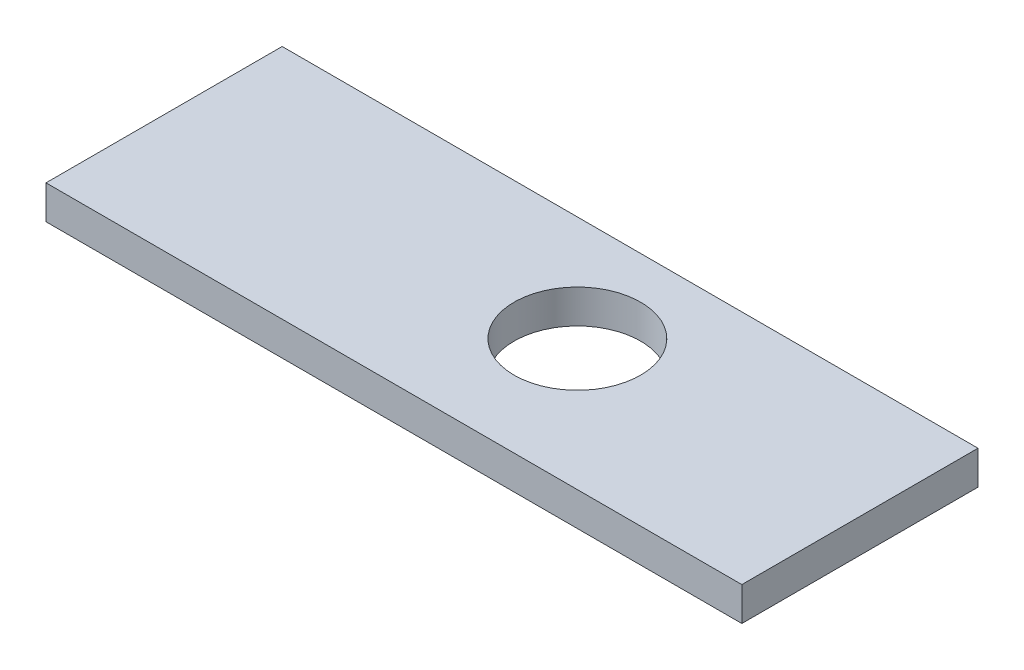
ISO-10303-21;
HEADER;
FILE_DESCRIPTION(('STEP AP214'),'2;1');
FILE_NAME('part.step','',(''),(''),'','','');
FILE_SCHEMA(('AUTOMOTIVE_DESIGN { 1 0 10303 214 1 1 1 1 }'));
ENDSEC;
DATA;
#1=APPLICATION_CONTEXT('core data for automotive mechanical design processes');
#2=APPLICATION_PROTOCOL_DEFINITION('international standard','automotive_design',2000,#1);
#3=PRODUCT_CONTEXT('',#1,'mechanical');
#4=PRODUCT('Part','Part','',(#3));
#5=PRODUCT_RELATED_PRODUCT_CATEGORY('part','',(#4));
#6=PRODUCT_DEFINITION_FORMATION('','',#4);
#7=PRODUCT_DEFINITION_CONTEXT('part definition',#1,'design');
#8=PRODUCT_DEFINITION('design','',#6,#7);
#9=PRODUCT_DEFINITION_SHAPE('','',#8);
#10=(LENGTH_UNIT() NAMED_UNIT(*) SI_UNIT(.MILLI.,.METRE.));
#11=(NAMED_UNIT(*) PLANE_ANGLE_UNIT() SI_UNIT($,.RADIAN.));
#12=(NAMED_UNIT(*) SI_UNIT($,.STERADIAN.) SOLID_ANGLE_UNIT());
#13=UNCERTAINTY_MEASURE_WITH_UNIT(LENGTH_MEASURE(1.E-05),#10,'distance_accuracy_value','');
#14=(GEOMETRIC_REPRESENTATION_CONTEXT(3) GLOBAL_UNCERTAINTY_ASSIGNED_CONTEXT((#13)) GLOBAL_UNIT_ASSIGNED_CONTEXT((#10,
#11,#12)) REPRESENTATION_CONTEXT('',''));
#15=CARTESIAN_POINT('',(0.,0.,0.));
#16=DIRECTION('',(0.,0.,1.));
#17=DIRECTION('',(1.,0.,0.));
#18=AXIS2_PLACEMENT_3D('',#15,#16,#17);
#19=CARTESIAN_POINT('',(0.,8.,0.));
#20=DIRECTION('',(0.,1.,0.));
#21=DIRECTION('',(0.,0.,1.));
#22=AXIS2_PLACEMENT_3D('',#19,#20,#21);
#23=PLANE('',#22);
#24=CARTESIAN_POINT('',(12.5,8.,-3.));
#25=DIRECTION('',(0.,1.,0.));
#26=DIRECTION('',(0.,0.,1.));
#27=AXIS2_PLACEMENT_3D('',#24,#25,#26);
#28=CIRCLE('',#27,15.);
#29=CARTESIAN_POINT('',(12.5,8.,12.));
#30=VERTEX_POINT('',#29);
#31=EDGE_CURVE('E20',#30,#30,#28,.F.);
#32=ORIENTED_EDGE('',*,*,#31,.T.);
#33=EDGE_LOOP('',(#32));
#34=FACE_BOUND('',#33,.T.);
#35=DIRECTION('',(-1.,0.,0.));
#36=VECTOR('',#35,1.);
#37=CARTESIAN_POINT('',(82.5,8.,-28.));
#38=LINE('',#37,#36);
#39=CARTESIAN_POINT('',(-82.5,8.,-28.));
#40=VERTEX_POINT('',#39);
#41=CARTESIAN_POINT('',(82.5,8.,-28.));
#42=VERTEX_POINT('',#41);
#43=EDGE_CURVE('E70',#40,#42,#38,.F.);
#44=ORIENTED_EDGE('',*,*,#43,.F.);
#45=DIRECTION('',(0.,0.,1.));
#46=VECTOR('',#45,1.);
#47=CARTESIAN_POINT('',(-82.5,8.,-28.));
#48=LINE('',#47,#46);
#49=CARTESIAN_POINT('',(-82.5,8.,28.));
#50=VERTEX_POINT('',#49);
#51=EDGE_CURVE('E67',#50,#40,#48,.F.);
#52=ORIENTED_EDGE('',*,*,#51,.F.);
#53=DIRECTION('',(1.,0.,0.));
#54=VECTOR('',#53,1.);
#55=CARTESIAN_POINT('',(-82.5,8.,28.));
#56=LINE('',#55,#54);
#57=CARTESIAN_POINT('',(82.5,8.,28.));
#58=VERTEX_POINT('',#57);
#59=EDGE_CURVE('E58',#58,#50,#56,.F.);
#60=ORIENTED_EDGE('',*,*,#59,.F.);
#61=DIRECTION('',(0.,0.,-1.));
#62=VECTOR('',#61,1.);
#63=CARTESIAN_POINT('',(82.5,8.,28.));
#64=LINE('',#63,#62);
#65=EDGE_CURVE('E53',#42,#58,#64,.F.);
#66=ORIENTED_EDGE('',*,*,#65,.F.);
#67=EDGE_LOOP('',(#44,#52,#60,#66));
#68=FACE_BOUND('',#67,.T.);
#69=ADVANCED_FACE('F17',(#34,#68),#23,.T.);
#70=CARTESIAN_POINT('',(-82.5,0.,-28.));
#71=DIRECTION('',(-1.,0.,0.));
#72=DIRECTION('',(0.,0.,1.));
#73=AXIS2_PLACEMENT_3D('',#70,#71,#72);
#74=PLANE('',#73);
#75=DIRECTION('',(0.,1.,0.));
#76=VECTOR('',#75,1.);
#77=CARTESIAN_POINT('',(-82.5,0.,-28.));
#78=LINE('',#77,#76);
#79=CARTESIAN_POINT('',(-82.5,0.,-28.));
#80=VERTEX_POINT('',#79);
#81=EDGE_CURVE('E82',#80,#40,#78,.T.);
#82=ORIENTED_EDGE('',*,*,#81,.F.);
#83=DIRECTION('',(0.,0.,1.));
#84=VECTOR('',#83,1.);
#85=CARTESIAN_POINT('',(-82.5,0.,0.));
#86=LINE('',#85,#84);
#87=CARTESIAN_POINT('',(-82.5,0.,28.));
#88=VERTEX_POINT('',#87);
#89=EDGE_CURVE('E77',#80,#88,#86,.T.);
#90=ORIENTED_EDGE('',*,*,#89,.T.);
#91=DIRECTION('',(0.,1.,0.));
#92=VECTOR('',#91,1.);
#93=CARTESIAN_POINT('',(-82.5,0.,28.));
#94=LINE('',#93,#92);
#95=EDGE_CURVE('E63',#50,#88,#94,.F.);
#96=ORIENTED_EDGE('',*,*,#95,.F.);
#97=ORIENTED_EDGE('',*,*,#51,.T.);
#98=EDGE_LOOP('',(#82,#90,#96,#97));
#99=FACE_BOUND('',#98,.T.);
#100=ADVANCED_FACE('F76',(#99),#74,.T.);
#101=CARTESIAN_POINT('',(-82.5,0.,28.));
#102=DIRECTION('',(0.,0.,1.));
#103=DIRECTION('',(1.,0.,0.));
#104=AXIS2_PLACEMENT_3D('',#101,#102,#103);
#105=PLANE('',#104);
#106=ORIENTED_EDGE('',*,*,#95,.T.);
#107=DIRECTION('',(1.,0.,0.));
#108=VECTOR('',#107,1.);
#109=CARTESIAN_POINT('',(0.,0.,28.));
#110=LINE('',#109,#108);
#111=CARTESIAN_POINT('',(82.5,0.,28.));
#112=VERTEX_POINT('',#111);
#113=EDGE_CURVE('E87',#88,#112,#110,.T.);
#114=ORIENTED_EDGE('',*,*,#113,.T.);
#115=DIRECTION('',(0.,1.,0.));
#116=VECTOR('',#115,1.);
#117=CARTESIAN_POINT('',(82.5,0.,28.));
#118=LINE('',#117,#116);
#119=EDGE_CURVE('E65',#58,#112,#118,.F.);
#120=ORIENTED_EDGE('',*,*,#119,.F.);
#121=ORIENTED_EDGE('',*,*,#59,.T.);
#122=EDGE_LOOP('',(#106,#114,#120,#121));
#123=FACE_BOUND('',#122,.T.);
#124=ADVANCED_FACE('F60',(#123),#105,.T.);
#125=CARTESIAN_POINT('',(82.5,0.,28.));
#126=DIRECTION('',(1.,0.,0.));
#127=DIRECTION('',(0.,0.,-1.));
#128=AXIS2_PLACEMENT_3D('',#125,#126,#127);
#129=PLANE('',#128);
#130=ORIENTED_EDGE('',*,*,#119,.T.);
#131=DIRECTION('',(0.,0.,1.));
#132=VECTOR('',#131,1.);
#133=CARTESIAN_POINT('',(82.5,0.,0.));
#134=LINE('',#133,#132);
#135=CARTESIAN_POINT('',(82.5,0.,-28.));
#136=VERTEX_POINT('',#135);
#137=EDGE_CURVE('E89',#112,#136,#134,.F.);
#138=ORIENTED_EDGE('',*,*,#137,.T.);
#139=DIRECTION('',(0.,1.,0.));
#140=VECTOR('',#139,1.);
#141=CARTESIAN_POINT('',(82.5,0.,-28.));
#142=LINE('',#141,#140);
#143=EDGE_CURVE('E34',#42,#136,#142,.F.);
#144=ORIENTED_EDGE('',*,*,#143,.F.);
#145=ORIENTED_EDGE('',*,*,#65,.T.);
#146=EDGE_LOOP('',(#130,#138,#144,#145));
#147=FACE_BOUND('',#146,.T.);
#148=ADVANCED_FACE('F96',(#147),#129,.T.);
#149=CARTESIAN_POINT('',(82.5,0.,-28.));
#150=DIRECTION('',(0.,0.,-1.));
#151=DIRECTION('',(-1.,0.,0.));
#152=AXIS2_PLACEMENT_3D('',#149,#150,#151);
#153=PLANE('',#152);
#154=ORIENTED_EDGE('',*,*,#143,.T.);
#155=DIRECTION('',(1.,0.,0.));
#156=VECTOR('',#155,1.);
#157=CARTESIAN_POINT('',(0.,0.,-28.));
#158=LINE('',#157,#156);
#159=EDGE_CURVE('E26',#136,#80,#158,.F.);
#160=ORIENTED_EDGE('',*,*,#159,.T.);
#161=ORIENTED_EDGE('',*,*,#81,.T.);
#162=ORIENTED_EDGE('',*,*,#43,.T.);
#163=EDGE_LOOP('',(#154,#160,#161,#162));
#164=FACE_BOUND('',#163,.T.);
#165=ADVANCED_FACE('F92',(#164),#153,.T.);
#166=CARTESIAN_POINT('',(12.5,0.,-3.));
#167=DIRECTION('',(0.,1.,0.));
#168=DIRECTION('',(0.,0.,1.));
#169=AXIS2_PLACEMENT_3D('',#166,#167,#168);
#170=CYLINDRICAL_SURFACE('',#169,15.);
#171=ORIENTED_EDGE('',*,*,#31,.F.);
#172=EDGE_LOOP('',(#171));
#173=FACE_BOUND('',#172,.T.);
#174=CARTESIAN_POINT('',(12.5,0.,-3.));
#175=DIRECTION('',(0.,1.,0.));
#176=DIRECTION('',(0.,0.,1.));
#177=AXIS2_PLACEMENT_3D('',#174,#175,#176);
#178=CIRCLE('',#177,15.);
#179=CARTESIAN_POINT('',(12.5,0.,12.));
#180=VERTEX_POINT('',#179);
#181=EDGE_CURVE('E11',#180,#180,#178,.F.);
#182=ORIENTED_EDGE('',*,*,#181,.T.);
#183=EDGE_LOOP('',(#182));
#184=FACE_BOUND('',#183,.T.);
#185=ADVANCED_FACE('F104',(#173,#184),#170,.F.);
#186=CARTESIAN_POINT('',(0.,0.,0.));
#187=DIRECTION('',(0.,1.,0.));
#188=DIRECTION('',(0.,0.,1.));
#189=AXIS2_PLACEMENT_3D('',#186,#187,#188);
#190=PLANE('',#189);
#191=ORIENTED_EDGE('',*,*,#181,.F.);
#192=EDGE_LOOP('',(#191));
#193=FACE_BOUND('',#192,.T.);
#194=ORIENTED_EDGE('',*,*,#137,.F.);
#195=ORIENTED_EDGE('',*,*,#113,.F.);
#196=ORIENTED_EDGE('',*,*,#89,.F.);
#197=ORIENTED_EDGE('',*,*,#159,.F.);
#198=EDGE_LOOP('',(#194,#195,#196,#197));
#199=FACE_BOUND('',#198,.T.);
#200=ADVANCED_FACE('F95',(#193,#199),#190,.F.);
#201=CLOSED_SHELL('',(#69,#100,#124,#148,#165,#185,#200));
#202=MANIFOLD_SOLID_BREP('B1',#201);
#203=ADVANCED_BREP_SHAPE_REPRESENTATION('',(#18,#202),#14);
#204=SHAPE_DEFINITION_REPRESENTATION(#9,#203);
ENDSEC;
END-ISO-10303-21;
